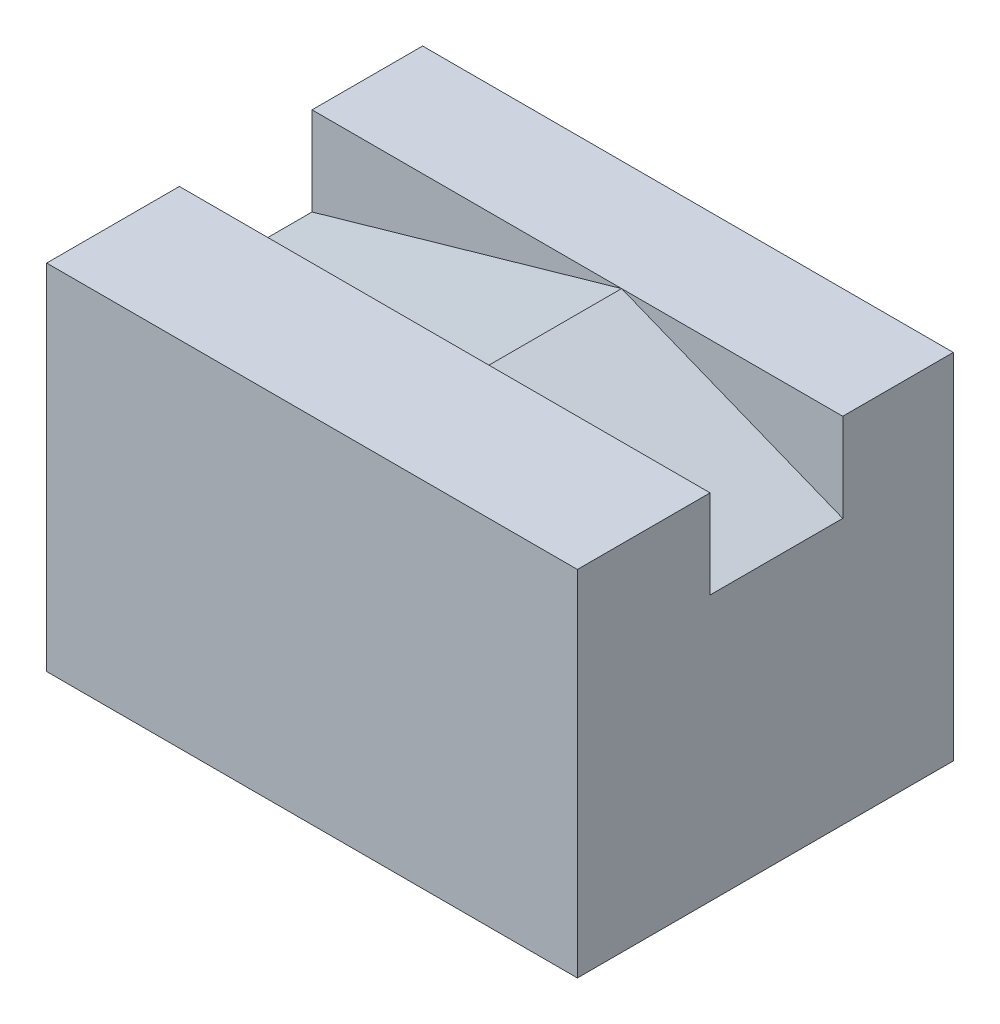
ISO-10303-21;
HEADER;
FILE_DESCRIPTION(('STEP AP214'),'2;1');
FILE_NAME('part.step','',(''),(''),'','','');
FILE_SCHEMA(('AUTOMOTIVE_DESIGN { 1 0 10303 214 1 1 1 1 }'));
ENDSEC;
DATA;
#1=APPLICATION_CONTEXT('core data for automotive mechanical design processes');
#2=APPLICATION_PROTOCOL_DEFINITION('international standard','automotive_design',2000,#1);
#3=PRODUCT_CONTEXT('',#1,'mechanical');
#4=PRODUCT('Part','Part','',(#3));
#5=PRODUCT_RELATED_PRODUCT_CATEGORY('part','',(#4));
#6=PRODUCT_DEFINITION_FORMATION('','',#4);
#7=PRODUCT_DEFINITION_CONTEXT('part definition',#1,'design');
#8=PRODUCT_DEFINITION('design','',#6,#7);
#9=PRODUCT_DEFINITION_SHAPE('','',#8);
#10=(LENGTH_UNIT() NAMED_UNIT(*) SI_UNIT(.MILLI.,.METRE.));
#11=(NAMED_UNIT(*) PLANE_ANGLE_UNIT() SI_UNIT($,.RADIAN.));
#12=(NAMED_UNIT(*) SI_UNIT($,.STERADIAN.) SOLID_ANGLE_UNIT());
#13=UNCERTAINTY_MEASURE_WITH_UNIT(LENGTH_MEASURE(1.E-05),#10,'distance_accuracy_value','');
#14=(GEOMETRIC_REPRESENTATION_CONTEXT(3) GLOBAL_UNCERTAINTY_ASSIGNED_CONTEXT((#13)) GLOBAL_UNIT_ASSIGNED_CONTEXT((#10,
#11,#12)) REPRESENTATION_CONTEXT('',''));
#15=CARTESIAN_POINT('',(0.,0.,0.));
#16=DIRECTION('',(0.,0.,1.));
#17=DIRECTION('',(1.,0.,0.));
#18=AXIS2_PLACEMENT_3D('',#15,#16,#17);
#19=CARTESIAN_POINT('',(0.,0.,0.));
#20=DIRECTION('',(0.,0.,1.));
#21=DIRECTION('',(1.,0.,0.));
#22=AXIS2_PLACEMENT_3D('',#19,#20,#21);
#23=PLANE('',#22);
#24=DIRECTION('',(1.,0.,0.));
#25=VECTOR('',#24,1.);
#26=CARTESIAN_POINT('',(0.,2.,0.));
#27=LINE('',#26,#25);
#28=CARTESIAN_POINT('',(0.499999999999999,2.,0.));
#29=VERTEX_POINT('',#28);
#30=CARTESIAN_POINT('',(3.,2.,0.));
#31=VERTEX_POINT('',#30);
#32=EDGE_CURVE('E169',#29,#31,#27,.T.);
#33=ORIENTED_EDGE('',*,*,#32,.F.);
#34=DIRECTION('',(0.928476690885259,-0.371390676354104,0.));
#35=VECTOR('',#34,1.);
#36=CARTESIAN_POINT('',(0.758620689655172,1.89655172413793,0.));
#37=LINE('',#36,#35);
#38=CARTESIAN_POINT('',(3.,0.999999999999998,0.));
#39=VERTEX_POINT('',#38);
#40=EDGE_CURVE('E84',#29,#39,#37,.T.);
#41=ORIENTED_EDGE('',*,*,#40,.T.);
#42=DIRECTION('',(0.,1.,0.));
#43=VECTOR('',#42,1.);
#44=CARTESIAN_POINT('',(3.,0.,0.));
#45=LINE('',#44,#43);
#46=EDGE_CURVE('E108',#39,#31,#45,.T.);
#47=ORIENTED_EDGE('',*,*,#46,.T.);
#48=EDGE_LOOP('',(#33,#41,#47));
#49=FACE_BOUND('',#48,.T.);
#50=ADVANCED_FACE('F66',(#49),#23,.T.);
#51=DIRECTION('',(0.,1.,0.));
#52=VECTOR('',#51,1.);
#53=CARTESIAN_POINT('',(-3.,0.,0.));
#54=LINE('',#53,#52);
#55=CARTESIAN_POINT('',(-3.,0.999999999999998,0.));
#56=VERTEX_POINT('',#55);
#57=CARTESIAN_POINT('',(-3.,2.,0.));
#58=VERTEX_POINT('',#57);
#59=EDGE_CURVE('E147',#56,#58,#54,.T.);
#60=ORIENTED_EDGE('',*,*,#59,.F.);
#61=DIRECTION('',(0.961523947640823,0.274721127897378,0.));
#62=VECTOR('',#61,1.);
#63=CARTESIAN_POINT('',(-0.490566037735849,1.71698113207547,0.));
#64=LINE('',#63,#62);
#65=EDGE_CURVE('E225',#56,#29,#64,.T.);
#66=ORIENTED_EDGE('',*,*,#65,.T.);
#67=EDGE_CURVE('E166',#58,#29,#27,.T.);
#68=ORIENTED_EDGE('',*,*,#67,.F.);
#69=EDGE_LOOP('',(#60,#66,#68));
#70=FACE_BOUND('',#69,.T.);
#71=ADVANCED_FACE('F268',(#70),#23,.T.);
#72=CARTESIAN_POINT('',(0.,-2.,-1.25));
#73=DIRECTION('',(0.,-1.,0.));
#74=DIRECTION('',(0.,0.,-1.));
#75=AXIS2_PLACEMENT_3D('',#72,#73,#74);
#76=PLANE('',#75);
#77=DIRECTION('',(0.,0.,1.));
#78=VECTOR('',#77,1.);
#79=CARTESIAN_POINT('',(3.,-2.,-1.25));
#80=LINE('',#79,#78);
#81=CARTESIAN_POINT('',(3.,-2.,-1.25));
#82=VERTEX_POINT('',#81);
#83=CARTESIAN_POINT('',(3.,-2.,3.));
#84=VERTEX_POINT('',#83);
#85=EDGE_CURVE('E12',#82,#84,#80,.T.);
#86=ORIENTED_EDGE('',*,*,#85,.T.);
#87=DIRECTION('',(-1.,0.,0.));
#88=VECTOR('',#87,1.);
#89=CARTESIAN_POINT('',(0.,-2.,3.));
#90=LINE('',#89,#88);
#91=CARTESIAN_POINT('',(-3.,-2.,3.));
#92=VERTEX_POINT('',#91);
#93=EDGE_CURVE('E188',#84,#92,#90,.T.);
#94=ORIENTED_EDGE('',*,*,#93,.T.);
#95=DIRECTION('',(0.,0.,1.));
#96=VECTOR('',#95,1.);
#97=CARTESIAN_POINT('',(-3.,-2.,-1.25));
#98=LINE('',#97,#96);
#99=CARTESIAN_POINT('',(-3.,-2.,-1.25));
#100=VERTEX_POINT('',#99);
#101=EDGE_CURVE('E76',#100,#92,#98,.T.);
#102=ORIENTED_EDGE('',*,*,#101,.F.);
#103=DIRECTION('',(1.,0.,0.));
#104=VECTOR('',#103,1.);
#105=CARTESIAN_POINT('',(0.,-2.,-1.25));
#106=LINE('',#105,#104);
#107=EDGE_CURVE('E138',#100,#82,#106,.T.);
#108=ORIENTED_EDGE('',*,*,#107,.T.);
#109=EDGE_LOOP('',(#86,#94,#102,#108));
#110=FACE_BOUND('',#109,.T.);
#111=ADVANCED_FACE('F194',(#110),#76,.T.);
#112=CARTESIAN_POINT('',(3.,0.,-1.25));
#113=DIRECTION('',(1.,0.,0.));
#114=DIRECTION('',(0.,1.,0.));
#115=AXIS2_PLACEMENT_3D('',#112,#113,#114);
#116=PLANE('',#115);
#117=ORIENTED_EDGE('',*,*,#46,.F.);
#118=DIRECTION('',(0.,0.,-1.));
#119=VECTOR('',#118,1.);
#120=CARTESIAN_POINT('',(3.,0.999999999999998,1.5));
#121=LINE('',#120,#119);
#122=CARTESIAN_POINT('',(3.,0.999999999999998,1.5));
#123=VERTEX_POINT('',#122);
#124=EDGE_CURVE('E229',#123,#39,#121,.T.);
#125=ORIENTED_EDGE('',*,*,#124,.F.);
#126=DIRECTION('',(0.,-1.,0.));
#127=VECTOR('',#126,1.);
#128=CARTESIAN_POINT('',(3.,0.,1.5));
#129=LINE('',#128,#127);
#130=CARTESIAN_POINT('',(3.,2.,1.5));
#131=VERTEX_POINT('',#130);
#132=EDGE_CURVE('E204',#131,#123,#129,.T.);
#133=ORIENTED_EDGE('',*,*,#132,.F.);
#134=DIRECTION('',(0.,0.,-1.));
#135=VECTOR('',#134,1.);
#136=CARTESIAN_POINT('',(3.,2.,3.));
#137=LINE('',#136,#135);
#138=CARTESIAN_POINT('',(3.,2.,3.));
#139=VERTEX_POINT('',#138);
#140=EDGE_CURVE('E215',#139,#131,#137,.T.);
#141=ORIENTED_EDGE('',*,*,#140,.F.);
#142=DIRECTION('',(0.,-1.,0.));
#143=VECTOR('',#142,1.);
#144=CARTESIAN_POINT('',(3.,0.,3.));
#145=LINE('',#144,#143);
#146=EDGE_CURVE('E196',#139,#84,#145,.T.);
#147=ORIENTED_EDGE('',*,*,#146,.T.);
#148=ORIENTED_EDGE('',*,*,#85,.F.);
#149=DIRECTION('',(0.,1.,0.));
#150=VECTOR('',#149,1.);
#151=CARTESIAN_POINT('',(3.,0.,-1.25));
#152=LINE('',#151,#150);
#153=CARTESIAN_POINT('',(3.,2.,-1.25));
#154=VERTEX_POINT('',#153);
#155=EDGE_CURVE('E152',#82,#154,#152,.T.);
#156=ORIENTED_EDGE('',*,*,#155,.T.);
#157=DIRECTION('',(0.,0.,1.));
#158=VECTOR('',#157,1.);
#159=CARTESIAN_POINT('',(3.,2.,-1.25));
#160=LINE('',#159,#158);
#161=EDGE_CURVE('E70',#154,#31,#160,.T.);
#162=ORIENTED_EDGE('',*,*,#161,.T.);
#163=EDGE_LOOP('',(#117,#125,#133,#141,#147,#148,#156,#162));
#164=FACE_BOUND('',#163,.T.);
#165=ADVANCED_FACE('F245',(#164),#116,.T.);
#166=CARTESIAN_POINT('',(0.,2.,-1.25));
#167=DIRECTION('',(0.,-1.,0.));
#168=DIRECTION('',(0.,0.,-1.));
#169=AXIS2_PLACEMENT_3D('',#166,#167,#168);
#170=PLANE('',#169);
#171=ORIENTED_EDGE('',*,*,#67,.T.);
#172=ORIENTED_EDGE('',*,*,#32,.T.);
#173=ORIENTED_EDGE('',*,*,#161,.F.);
#174=DIRECTION('',(1.,0.,0.));
#175=VECTOR('',#174,1.);
#176=CARTESIAN_POINT('',(0.,2.,-1.25));
#177=LINE('',#176,#175);
#178=CARTESIAN_POINT('',(-3.,2.,-1.25));
#179=VERTEX_POINT('',#178);
#180=EDGE_CURVE('E135',#179,#154,#177,.T.);
#181=ORIENTED_EDGE('',*,*,#180,.F.);
#182=DIRECTION('',(0.,0.,1.));
#183=VECTOR('',#182,1.);
#184=CARTESIAN_POINT('',(-3.,2.,-1.25));
#185=LINE('',#184,#183);
#186=EDGE_CURVE('E144',#179,#58,#185,.T.);
#187=ORIENTED_EDGE('',*,*,#186,.T.);
#188=EDGE_LOOP('',(#171,#172,#173,#181,#187));
#189=FACE_BOUND('',#188,.T.);
#190=ADVANCED_FACE('F68',(#189),#170,.F.);
#191=CARTESIAN_POINT('',(-3.,0.,-1.25));
#192=DIRECTION('',(1.,0.,0.));
#193=DIRECTION('',(0.,1.,0.));
#194=AXIS2_PLACEMENT_3D('',#191,#192,#193);
#195=PLANE('',#194);
#196=ORIENTED_EDGE('',*,*,#101,.T.);
#197=DIRECTION('',(0.,-1.,0.));
#198=VECTOR('',#197,1.);
#199=CARTESIAN_POINT('',(-3.,0.,3.));
#200=LINE('',#199,#198);
#201=CARTESIAN_POINT('',(-3.,2.,3.));
#202=VERTEX_POINT('',#201);
#203=EDGE_CURVE('E178',#202,#92,#200,.T.);
#204=ORIENTED_EDGE('',*,*,#203,.F.);
#205=DIRECTION('',(0.,0.,-1.));
#206=VECTOR('',#205,1.);
#207=CARTESIAN_POINT('',(-3.,2.,3.));
#208=LINE('',#207,#206);
#209=CARTESIAN_POINT('',(-3.,2.,1.5));
#210=VERTEX_POINT('',#209);
#211=EDGE_CURVE('E203',#202,#210,#208,.T.);
#212=ORIENTED_EDGE('',*,*,#211,.T.);
#213=DIRECTION('',(0.,-1.,0.));
#214=VECTOR('',#213,1.);
#215=CARTESIAN_POINT('',(-3.,0.,1.5));
#216=LINE('',#215,#214);
#217=CARTESIAN_POINT('',(-3.,0.999999999999998,1.5));
#218=VERTEX_POINT('',#217);
#219=EDGE_CURVE('E208',#210,#218,#216,.T.);
#220=ORIENTED_EDGE('',*,*,#219,.T.);
#221=DIRECTION('',(0.,0.,-1.));
#222=VECTOR('',#221,1.);
#223=CARTESIAN_POINT('',(-3.,0.999999999999998,1.5));
#224=LINE('',#223,#222);
#225=EDGE_CURVE('E236',#218,#56,#224,.T.);
#226=ORIENTED_EDGE('',*,*,#225,.T.);
#227=ORIENTED_EDGE('',*,*,#59,.T.);
#228=ORIENTED_EDGE('',*,*,#186,.F.);
#229=DIRECTION('',(0.,1.,0.));
#230=VECTOR('',#229,1.);
#231=CARTESIAN_POINT('',(-3.,0.,-1.25));
#232=LINE('',#231,#230);
#233=EDGE_CURVE('E131',#100,#179,#232,.T.);
#234=ORIENTED_EDGE('',*,*,#233,.F.);
#235=EDGE_LOOP('',(#196,#204,#212,#220,#226,#227,#228,#234));
#236=FACE_BOUND('',#235,.T.);
#237=ADVANCED_FACE('F145',(#236),#195,.F.);
#238=CARTESIAN_POINT('',(0.,0.,-1.25));
#239=DIRECTION('',(0.,0.,1.));
#240=DIRECTION('',(1.,0.,0.));
#241=AXIS2_PLACEMENT_3D('',#238,#239,#240);
#242=PLANE('',#241);
#243=ORIENTED_EDGE('',*,*,#180,.T.);
#244=ORIENTED_EDGE('',*,*,#155,.F.);
#245=ORIENTED_EDGE('',*,*,#107,.F.);
#246=ORIENTED_EDGE('',*,*,#233,.T.);
#247=EDGE_LOOP('',(#243,#244,#245,#246));
#248=FACE_BOUND('',#247,.T.);
#249=ADVANCED_FACE('F133',(#248),#242,.F.);
#250=CARTESIAN_POINT('',(0.758620689655172,1.89655172413793,1.5));
#251=DIRECTION('',(0.371390676354104,0.928476690885259,0.));
#252=DIRECTION('',(-0.928476690885259,0.371390676354104,0.));
#253=AXIS2_PLACEMENT_3D('',#250,#251,#252);
#254=PLANE('',#253);
#255=ORIENTED_EDGE('',*,*,#40,.F.);
#256=DIRECTION('',(0.,0.,-1.));
#257=VECTOR('',#256,1.);
#258=CARTESIAN_POINT('',(0.5,2.,1.5));
#259=LINE('',#258,#257);
#260=CARTESIAN_POINT('',(0.5,2.,1.5));
#261=VERTEX_POINT('',#260);
#262=EDGE_CURVE('E159',#261,#29,#259,.T.);
#263=ORIENTED_EDGE('',*,*,#262,.F.);
#264=DIRECTION('',(0.928476690885259,-0.371390676354104,0.));
#265=VECTOR('',#264,1.);
#266=CARTESIAN_POINT('',(0.758620689655172,1.89655172413793,1.5));
#267=LINE('',#266,#265);
#268=EDGE_CURVE('E220',#261,#123,#267,.T.);
#269=ORIENTED_EDGE('',*,*,#268,.T.);
#270=ORIENTED_EDGE('',*,*,#124,.T.);
#271=EDGE_LOOP('',(#255,#263,#269,#270));
#272=FACE_BOUND('',#271,.T.);
#273=ADVANCED_FACE('F252',(#272),#254,.T.);
#274=CARTESIAN_POINT('',(-0.490566037735849,1.71698113207547,1.5));
#275=DIRECTION('',(-0.274721127897378,0.961523947640823,0.));
#276=DIRECTION('',(-0.961523947640823,-0.274721127897378,0.));
#277=AXIS2_PLACEMENT_3D('',#274,#275,#276);
#278=PLANE('',#277);
#279=ORIENTED_EDGE('',*,*,#65,.F.);
#280=ORIENTED_EDGE('',*,*,#225,.F.);
#281=DIRECTION('',(0.961523947640823,0.274721127897378,0.));
#282=VECTOR('',#281,1.);
#283=CARTESIAN_POINT('',(-0.490566037735849,1.71698113207547,1.5));
#284=LINE('',#283,#282);
#285=EDGE_CURVE('E224',#218,#261,#284,.T.);
#286=ORIENTED_EDGE('',*,*,#285,.T.);
#287=ORIENTED_EDGE('',*,*,#262,.T.);
#288=EDGE_LOOP('',(#279,#280,#286,#287));
#289=FACE_BOUND('',#288,.T.);
#290=ADVANCED_FACE('F266',(#289),#278,.T.);
#291=CARTESIAN_POINT('',(0.,0.,1.5));
#292=DIRECTION('',(0.,0.,-1.));
#293=DIRECTION('',(-1.,0.,0.));
#294=AXIS2_PLACEMENT_3D('',#291,#292,#293);
#295=PLANE('',#294);
#296=ORIENTED_EDGE('',*,*,#268,.F.);
#297=DIRECTION('',(-1.,0.,0.));
#298=VECTOR('',#297,1.);
#299=CARTESIAN_POINT('',(0.,2.,1.5));
#300=LINE('',#299,#298);
#301=EDGE_CURVE('E117',#131,#261,#300,.T.);
#302=ORIENTED_EDGE('',*,*,#301,.F.);
#303=ORIENTED_EDGE('',*,*,#132,.T.);
#304=EDGE_LOOP('',(#296,#302,#303));
#305=FACE_BOUND('',#304,.T.);
#306=ADVANCED_FACE('F254',(#305),#295,.T.);
#307=ORIENTED_EDGE('',*,*,#285,.F.);
#308=ORIENTED_EDGE('',*,*,#219,.F.);
#309=EDGE_CURVE('E212',#261,#210,#300,.T.);
#310=ORIENTED_EDGE('',*,*,#309,.F.);
#311=EDGE_LOOP('',(#307,#308,#310));
#312=FACE_BOUND('',#311,.T.);
#313=ADVANCED_FACE('F265',(#312),#295,.T.);
#314=CARTESIAN_POINT('',(0.,2.,3.));
#315=DIRECTION('',(0.,-1.,0.));
#316=DIRECTION('',(0.,0.,-1.));
#317=AXIS2_PLACEMENT_3D('',#314,#315,#316);
#318=PLANE('',#317);
#319=ORIENTED_EDGE('',*,*,#301,.T.);
#320=ORIENTED_EDGE('',*,*,#309,.T.);
#321=ORIENTED_EDGE('',*,*,#211,.F.);
#322=DIRECTION('',(-1.,0.,0.));
#323=VECTOR('',#322,1.);
#324=CARTESIAN_POINT('',(0.,2.,3.));
#325=LINE('',#324,#323);
#326=EDGE_CURVE('E190',#139,#202,#325,.T.);
#327=ORIENTED_EDGE('',*,*,#326,.F.);
#328=ORIENTED_EDGE('',*,*,#140,.T.);
#329=EDGE_LOOP('',(#319,#320,#321,#327,#328));
#330=FACE_BOUND('',#329,.T.);
#331=ADVANCED_FACE('F261',(#330),#318,.F.);
#332=CARTESIAN_POINT('',(0.,0.,3.));
#333=DIRECTION('',(0.,0.,-1.));
#334=DIRECTION('',(-1.,0.,0.));
#335=AXIS2_PLACEMENT_3D('',#332,#333,#334);
#336=PLANE('',#335);
#337=ORIENTED_EDGE('',*,*,#146,.F.);
#338=ORIENTED_EDGE('',*,*,#326,.T.);
#339=ORIENTED_EDGE('',*,*,#203,.T.);
#340=ORIENTED_EDGE('',*,*,#93,.F.);
#341=EDGE_LOOP('',(#337,#338,#339,#340));
#342=FACE_BOUND('',#341,.T.);
#343=ADVANCED_FACE('F187',(#342),#336,.F.);
#344=CLOSED_SHELL('',(#50,#71,#111,#165,#190,#237,#249,#273,#290,#306,#313,#331,#343));
#345=MANIFOLD_SOLID_BREP('B2',#344);
#346=ADVANCED_BREP_SHAPE_REPRESENTATION('',(#18,#345),#14);
#347=SHAPE_DEFINITION_REPRESENTATION(#9,#346);
ENDSEC;
END-ISO-10303-21;
